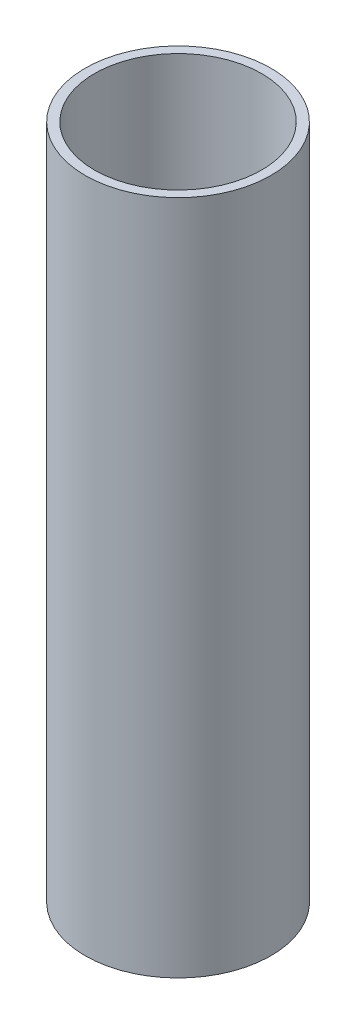
ISO-10303-21;
HEADER;
FILE_DESCRIPTION(('STEP AP214'),'2;1');
FILE_NAME('part.step','',(''),(''),'','','');
FILE_SCHEMA(('AUTOMOTIVE_DESIGN { 1 0 10303 214 1 1 1 1 }'));
ENDSEC;
DATA;
#1=APPLICATION_CONTEXT('core data for automotive mechanical design processes');
#2=APPLICATION_PROTOCOL_DEFINITION('international standard','automotive_design',2000,#1);
#3=PRODUCT_CONTEXT('',#1,'mechanical');
#4=PRODUCT('Part','Part','',(#3));
#5=PRODUCT_RELATED_PRODUCT_CATEGORY('part','',(#4));
#6=PRODUCT_DEFINITION_FORMATION('','',#4);
#7=PRODUCT_DEFINITION_CONTEXT('part definition',#1,'design');
#8=PRODUCT_DEFINITION('design','',#6,#7);
#9=PRODUCT_DEFINITION_SHAPE('','',#8);
#10=(LENGTH_UNIT() NAMED_UNIT(*) SI_UNIT(.MILLI.,.METRE.));
#11=(NAMED_UNIT(*) PLANE_ANGLE_UNIT() SI_UNIT($,.RADIAN.));
#12=(NAMED_UNIT(*) SI_UNIT($,.STERADIAN.) SOLID_ANGLE_UNIT());
#13=UNCERTAINTY_MEASURE_WITH_UNIT(LENGTH_MEASURE(1.E-05),#10,'distance_accuracy_value','');
#14=(GEOMETRIC_REPRESENTATION_CONTEXT(3) GLOBAL_UNCERTAINTY_ASSIGNED_CONTEXT((#13)) GLOBAL_UNIT_ASSIGNED_CONTEXT((#10,
#11,#12)) REPRESENTATION_CONTEXT('',''));
#15=CARTESIAN_POINT('',(0.,0.,0.));
#16=DIRECTION('',(0.,0.,1.));
#17=DIRECTION('',(1.,0.,0.));
#18=AXIS2_PLACEMENT_3D('',#15,#16,#17);
#19=CARTESIAN_POINT('',(0.,60.,0.));
#20=DIRECTION('',(0.,1.,0.));
#21=DIRECTION('',(0.,0.,1.));
#22=AXIS2_PLACEMENT_3D('',#19,#20,#21);
#23=PLANE('',#22);
#24=CARTESIAN_POINT('',(0.,60.,0.));
#25=DIRECTION('',(0.,1.,0.));
#26=DIRECTION('',(0.,0.,1.));
#27=AXIS2_PLACEMENT_3D('',#24,#25,#26);
#28=CIRCLE('',#27,16.5);
#29=CARTESIAN_POINT('',(0.,60.,16.5));
#30=VERTEX_POINT('',#29);
#31=EDGE_CURVE('E10',#30,#30,#28,.T.);
#32=ORIENTED_EDGE('',*,*,#31,.T.);
#33=EDGE_LOOP('',(#32));
#34=FACE_BOUND('',#33,.T.);
#35=CARTESIAN_POINT('',(0.,60.,0.));
#36=DIRECTION('',(0.,1.,0.));
#37=DIRECTION('',(0.,0.,1.));
#38=AXIS2_PLACEMENT_3D('',#35,#36,#37);
#39=CIRCLE('',#38,14.85);
#40=CARTESIAN_POINT('',(0.,60.,14.85));
#41=VERTEX_POINT('',#40);
#42=EDGE_CURVE('E41',#41,#41,#39,.T.);
#43=ORIENTED_EDGE('',*,*,#42,.F.);
#44=EDGE_LOOP('',(#43));
#45=FACE_BOUND('',#44,.T.);
#46=ADVANCED_FACE('F30',(#34,#45),#23,.T.);
#47=CARTESIAN_POINT('',(0.,-60.,0.));
#48=DIRECTION('',(0.,1.,0.));
#49=DIRECTION('',(0.,0.,1.));
#50=AXIS2_PLACEMENT_3D('',#47,#48,#49);
#51=PLANE('',#50);
#52=CARTESIAN_POINT('',(0.,-60.,0.));
#53=DIRECTION('',(0.,1.,0.));
#54=DIRECTION('',(0.,0.,1.));
#55=AXIS2_PLACEMENT_3D('',#52,#53,#54);
#56=CIRCLE('',#55,16.5);
#57=CARTESIAN_POINT('',(0.,-60.,16.5));
#58=VERTEX_POINT('',#57);
#59=EDGE_CURVE('E34',#58,#58,#56,.T.);
#60=ORIENTED_EDGE('',*,*,#59,.F.);
#61=EDGE_LOOP('',(#60));
#62=FACE_BOUND('',#61,.T.);
#63=CARTESIAN_POINT('',(0.,-60.,0.));
#64=DIRECTION('',(0.,1.,0.));
#65=DIRECTION('',(0.,0.,1.));
#66=AXIS2_PLACEMENT_3D('',#63,#64,#65);
#67=CIRCLE('',#66,14.85);
#68=CARTESIAN_POINT('',(0.,-60.,14.85));
#69=VERTEX_POINT('',#68);
#70=EDGE_CURVE('E43',#69,#69,#67,.T.);
#71=ORIENTED_EDGE('',*,*,#70,.T.);
#72=EDGE_LOOP('',(#71));
#73=FACE_BOUND('',#72,.T.);
#74=ADVANCED_FACE('F53',(#62,#73),#51,.F.);
#75=CARTESIAN_POINT('',(0.,60.,0.));
#76=DIRECTION('',(0.,-1.,0.));
#77=DIRECTION('',(0.,0.,-1.));
#78=AXIS2_PLACEMENT_3D('',#75,#76,#77);
#79=CYLINDRICAL_SURFACE('',#78,16.5);
#80=ORIENTED_EDGE('',*,*,#31,.F.);
#81=EDGE_LOOP('',(#80));
#82=FACE_BOUND('',#81,.T.);
#83=ORIENTED_EDGE('',*,*,#59,.T.);
#84=EDGE_LOOP('',(#83));
#85=FACE_BOUND('',#84,.T.);
#86=ADVANCED_FACE('F32',(#82,#85),#79,.T.);
#87=CARTESIAN_POINT('',(0.,60.,0.));
#88=DIRECTION('',(0.,-1.,0.));
#89=DIRECTION('',(0.,0.,-1.));
#90=AXIS2_PLACEMENT_3D('',#87,#88,#89);
#91=CYLINDRICAL_SURFACE('',#90,14.85);
#92=ORIENTED_EDGE('',*,*,#42,.T.);
#93=EDGE_LOOP('',(#92));
#94=FACE_BOUND('',#93,.T.);
#95=ORIENTED_EDGE('',*,*,#70,.F.);
#96=EDGE_LOOP('',(#95));
#97=FACE_BOUND('',#96,.T.);
#98=ADVANCED_FACE('F49',(#94,#97),#91,.F.);
#99=CLOSED_SHELL('',(#46,#74,#86,#98));
#100=MANIFOLD_SOLID_BREP('B2',#99);
#101=ADVANCED_BREP_SHAPE_REPRESENTATION('',(#18,#100),#14);
#102=SHAPE_DEFINITION_REPRESENTATION(#9,#101);
ENDSEC;
END-ISO-10303-21;
